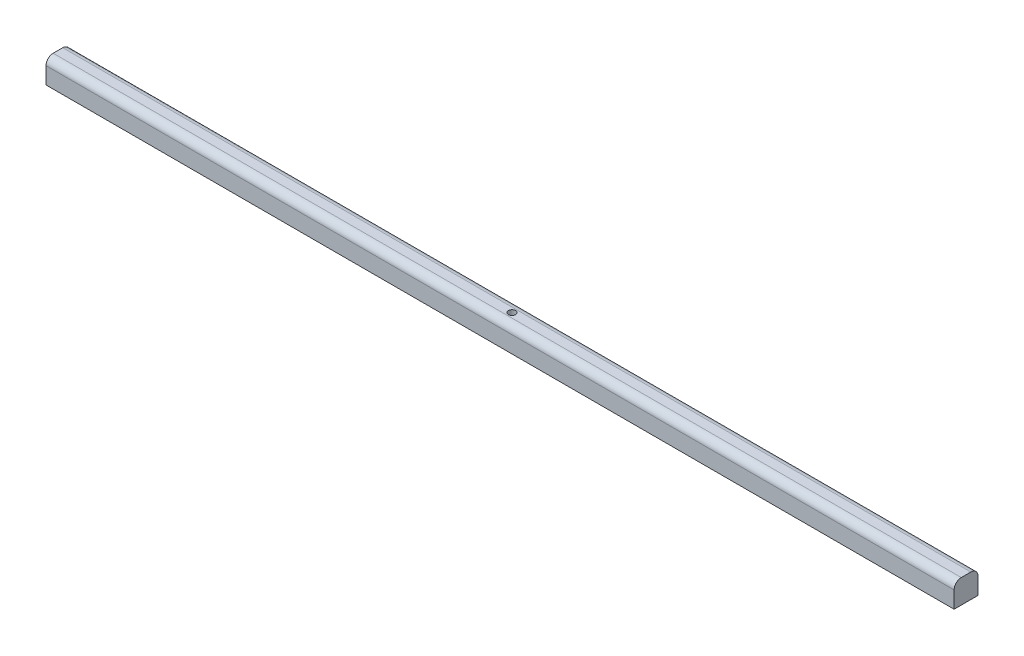
ISO-10303-21;
HEADER;
FILE_DESCRIPTION(('STEP AP214'),'2;1');
FILE_NAME('part.step','',(''),(''),'','','');
FILE_SCHEMA(('AUTOMOTIVE_DESIGN { 1 0 10303 214 1 1 1 1 }'));
ENDSEC;
DATA;
#1=APPLICATION_CONTEXT('core data for automotive mechanical design processes');
#2=APPLICATION_PROTOCOL_DEFINITION('international standard','automotive_design',2000,#1);
#3=PRODUCT_CONTEXT('',#1,'mechanical');
#4=PRODUCT('Part','Part','',(#3));
#5=PRODUCT_RELATED_PRODUCT_CATEGORY('part','',(#4));
#6=PRODUCT_DEFINITION_FORMATION('','',#4);
#7=PRODUCT_DEFINITION_CONTEXT('part definition',#1,'design');
#8=PRODUCT_DEFINITION('design','',#6,#7);
#9=PRODUCT_DEFINITION_SHAPE('','',#8);
#10=(LENGTH_UNIT() NAMED_UNIT(*) SI_UNIT(.MILLI.,.METRE.));
#11=(NAMED_UNIT(*) PLANE_ANGLE_UNIT() SI_UNIT($,.RADIAN.));
#12=(NAMED_UNIT(*) SI_UNIT($,.STERADIAN.) SOLID_ANGLE_UNIT());
#13=UNCERTAINTY_MEASURE_WITH_UNIT(LENGTH_MEASURE(1.E-05),#10,'distance_accuracy_value','');
#14=(GEOMETRIC_REPRESENTATION_CONTEXT(3) GLOBAL_UNCERTAINTY_ASSIGNED_CONTEXT((#13)) GLOBAL_UNIT_ASSIGNED_CONTEXT((#10,
#11,#12)) REPRESENTATION_CONTEXT('',''));
#15=CARTESIAN_POINT('',(0.,0.,0.));
#16=DIRECTION('',(0.,0.,1.));
#17=DIRECTION('',(1.,0.,0.));
#18=AXIS2_PLACEMENT_3D('',#15,#16,#17);
#19=CARTESIAN_POINT('',(190.,10.,-5.));
#20=DIRECTION('',(-1.,0.,0.));
#21=DIRECTION('',(0.,0.,1.));
#22=AXIS2_PLACEMENT_3D('',#19,#20,#21);
#23=PLANE('',#22);
#24=DIRECTION('',(0.,-1.,0.));
#25=VECTOR('',#24,1.);
#26=CARTESIAN_POINT('',(190.,10.,-5.));
#27=LINE('',#26,#25);
#28=CARTESIAN_POINT('',(190.,7.,-5.));
#29=VERTEX_POINT('',#28);
#30=CARTESIAN_POINT('',(190.,0.,-5.));
#31=VERTEX_POINT('',#30);
#32=EDGE_CURVE('E95',#29,#31,#27,.T.);
#33=ORIENTED_EDGE('',*,*,#32,.F.);
#34=CARTESIAN_POINT('',(190.,7.,-2.));
#35=DIRECTION('',(-1.,0.,0.));
#36=DIRECTION('',(0.,0.,1.));
#37=AXIS2_PLACEMENT_3D('',#34,#35,#36);
#38=CIRCLE('',#37,3.);
#39=CARTESIAN_POINT('',(190.,10.,-2.));
#40=VERTEX_POINT('',#39);
#41=EDGE_CURVE('E52',#29,#40,#38,.F.);
#42=ORIENTED_EDGE('',*,*,#41,.T.);
#43=DIRECTION('',(0.,0.,-1.));
#44=VECTOR('',#43,1.);
#45=CARTESIAN_POINT('',(190.,10.,-5.));
#46=LINE('',#45,#44);
#47=CARTESIAN_POINT('',(190.,10.,2.));
#48=VERTEX_POINT('',#47);
#49=EDGE_CURVE('E133',#48,#40,#46,.T.);
#50=ORIENTED_EDGE('',*,*,#49,.F.);
#51=CARTESIAN_POINT('',(190.,7.,2.));
#52=DIRECTION('',(-1.,0.,0.));
#53=DIRECTION('',(0.,0.,1.));
#54=AXIS2_PLACEMENT_3D('',#51,#52,#53);
#55=CIRCLE('',#54,3.);
#56=CARTESIAN_POINT('',(190.,7.,5.));
#57=VERTEX_POINT('',#56);
#58=EDGE_CURVE('E59',#48,#57,#55,.F.);
#59=ORIENTED_EDGE('',*,*,#58,.T.);
#60=DIRECTION('',(0.,-1.,0.));
#61=VECTOR('',#60,1.);
#62=CARTESIAN_POINT('',(190.,10.,5.));
#63=LINE('',#62,#61);
#64=CARTESIAN_POINT('',(190.,0.,5.));
#65=VERTEX_POINT('',#64);
#66=EDGE_CURVE('E115',#57,#65,#63,.T.);
#67=ORIENTED_EDGE('',*,*,#66,.T.);
#68=DIRECTION('',(0.,0.,-1.));
#69=VECTOR('',#68,1.);
#70=CARTESIAN_POINT('',(190.,0.,-5.));
#71=LINE('',#70,#69);
#72=EDGE_CURVE('E110',#65,#31,#71,.T.);
#73=ORIENTED_EDGE('',*,*,#72,.T.);
#74=EDGE_LOOP('',(#33,#42,#50,#59,#67,#73));
#75=FACE_BOUND('',#74,.T.);
#76=ADVANCED_FACE('F43',(#75),#23,.F.);
#77=CARTESIAN_POINT('',(-190.,10.,-5.));
#78=DIRECTION('',(0.,0.,1.));
#79=DIRECTION('',(1.,0.,0.));
#80=AXIS2_PLACEMENT_3D('',#77,#78,#79);
#81=PLANE('',#80);
#82=DIRECTION('',(0.,-1.,0.));
#83=VECTOR('',#82,1.);
#84=CARTESIAN_POINT('',(-190.,10.,-5.));
#85=LINE('',#84,#83);
#86=CARTESIAN_POINT('',(-190.,7.,-5.));
#87=VERTEX_POINT('',#86);
#88=CARTESIAN_POINT('',(-190.,0.,-5.));
#89=VERTEX_POINT('',#88);
#90=EDGE_CURVE('E104',#87,#89,#85,.T.);
#91=ORIENTED_EDGE('',*,*,#90,.F.);
#92=DIRECTION('',(-1.,0.,0.));
#93=VECTOR('',#92,1.);
#94=CARTESIAN_POINT('',(190.,7.,-5.));
#95=LINE('',#94,#93);
#96=EDGE_CURVE('E67',#87,#29,#95,.F.);
#97=ORIENTED_EDGE('',*,*,#96,.T.);
#98=ORIENTED_EDGE('',*,*,#32,.T.);
#99=DIRECTION('',(-1.,0.,0.));
#100=VECTOR('',#99,1.);
#101=CARTESIAN_POINT('',(-190.,0.,-5.));
#102=LINE('',#101,#100);
#103=EDGE_CURVE('E98',#31,#89,#102,.T.);
#104=ORIENTED_EDGE('',*,*,#103,.T.);
#105=EDGE_LOOP('',(#91,#97,#98,#104));
#106=FACE_BOUND('',#105,.T.);
#107=ADVANCED_FACE('F97',(#106),#81,.F.);
#108=CARTESIAN_POINT('',(-190.,10.,-5.));
#109=DIRECTION('',(1.,0.,0.));
#110=DIRECTION('',(0.,0.,-1.));
#111=AXIS2_PLACEMENT_3D('',#108,#109,#110);
#112=PLANE('',#111);
#113=DIRECTION('',(0.,0.,1.));
#114=VECTOR('',#113,1.);
#115=CARTESIAN_POINT('',(-190.,10.,-5.));
#116=LINE('',#115,#114);
#117=CARTESIAN_POINT('',(-190.,10.,-2.));
#118=VERTEX_POINT('',#117);
#119=CARTESIAN_POINT('',(-190.,10.,2.));
#120=VERTEX_POINT('',#119);
#121=EDGE_CURVE('E125',#118,#120,#116,.T.);
#122=ORIENTED_EDGE('',*,*,#121,.F.);
#123=CARTESIAN_POINT('',(-190.,7.,-2.));
#124=DIRECTION('',(1.,0.,0.));
#125=DIRECTION('',(0.,0.,-1.));
#126=AXIS2_PLACEMENT_3D('',#123,#124,#125);
#127=CIRCLE('',#126,3.);
#128=EDGE_CURVE('E151',#118,#87,#127,.F.);
#129=ORIENTED_EDGE('',*,*,#128,.T.);
#130=ORIENTED_EDGE('',*,*,#90,.T.);
#131=DIRECTION('',(0.,0.,1.));
#132=VECTOR('',#131,1.);
#133=CARTESIAN_POINT('',(-190.,0.,-5.));
#134=LINE('',#133,#132);
#135=CARTESIAN_POINT('',(-190.,0.,5.));
#136=VERTEX_POINT('',#135);
#137=EDGE_CURVE('E112',#89,#136,#134,.T.);
#138=ORIENTED_EDGE('',*,*,#137,.T.);
#139=DIRECTION('',(0.,-1.,0.));
#140=VECTOR('',#139,1.);
#141=CARTESIAN_POINT('',(-190.,10.,5.));
#142=LINE('',#141,#140);
#143=CARTESIAN_POINT('',(-190.,7.,5.));
#144=VERTEX_POINT('',#143);
#145=EDGE_CURVE('E136',#144,#136,#142,.T.);
#146=ORIENTED_EDGE('',*,*,#145,.F.);
#147=CARTESIAN_POINT('',(-190.,7.,2.));
#148=DIRECTION('',(1.,0.,0.));
#149=DIRECTION('',(0.,0.,-1.));
#150=AXIS2_PLACEMENT_3D('',#147,#148,#149);
#151=CIRCLE('',#150,3.);
#152=EDGE_CURVE('E148',#144,#120,#151,.F.);
#153=ORIENTED_EDGE('',*,*,#152,.T.);
#154=EDGE_LOOP('',(#122,#129,#130,#138,#146,#153));
#155=FACE_BOUND('',#154,.T.);
#156=ADVANCED_FACE('F169',(#155),#112,.F.);
#157=CARTESIAN_POINT('',(-190.,10.,5.));
#158=DIRECTION('',(0.,0.,-1.));
#159=DIRECTION('',(-1.,0.,0.));
#160=AXIS2_PLACEMENT_3D('',#157,#158,#159);
#161=PLANE('',#160);
#162=ORIENTED_EDGE('',*,*,#66,.F.);
#163=DIRECTION('',(1.,0.,0.));
#164=VECTOR('',#163,1.);
#165=CARTESIAN_POINT('',(-190.,7.,5.));
#166=LINE('',#165,#164);
#167=EDGE_CURVE('E11',#57,#144,#166,.F.);
#168=ORIENTED_EDGE('',*,*,#167,.T.);
#169=ORIENTED_EDGE('',*,*,#145,.T.);
#170=DIRECTION('',(1.,0.,0.));
#171=VECTOR('',#170,1.);
#172=CARTESIAN_POINT('',(-190.,0.,5.));
#173=LINE('',#172,#171);
#174=EDGE_CURVE('E130',#136,#65,#173,.T.);
#175=ORIENTED_EDGE('',*,*,#174,.T.);
#176=EDGE_LOOP('',(#162,#168,#169,#175));
#177=FACE_BOUND('',#176,.T.);
#178=ADVANCED_FACE('F176',(#177),#161,.F.);
#179=CARTESIAN_POINT('',(0.,10.,0.));
#180=DIRECTION('',(0.,1.,0.));
#181=DIRECTION('',(0.,0.,1.));
#182=AXIS2_PLACEMENT_3D('',#179,#180,#181);
#183=PLANE('',#182);
#184=CARTESIAN_POINT('',(0.,10.,0.));
#185=DIRECTION('',(0.,-1.,0.));
#186=DIRECTION('',(0.,0.,-1.));
#187=AXIS2_PLACEMENT_3D('',#184,#185,#186);
#188=CIRCLE('',#187,1.5);
#189=CARTESIAN_POINT('',(0.,10.,-1.5));
#190=VERTEX_POINT('',#189);
#191=EDGE_CURVE('E118',#190,#190,#188,.T.);
#192=ORIENTED_EDGE('',*,*,#191,.T.);
#193=EDGE_LOOP('',(#192));
#194=FACE_BOUND('',#193,.T.);
#195=ORIENTED_EDGE('',*,*,#49,.T.);
#196=DIRECTION('',(-1.,0.,0.));
#197=VECTOR('',#196,1.);
#198=CARTESIAN_POINT('',(-190.,10.,-2.));
#199=LINE('',#198,#197);
#200=EDGE_CURVE('E144',#40,#118,#199,.T.);
#201=ORIENTED_EDGE('',*,*,#200,.T.);
#202=ORIENTED_EDGE('',*,*,#121,.T.);
#203=DIRECTION('',(1.,0.,0.));
#204=VECTOR('',#203,1.);
#205=CARTESIAN_POINT('',(190.,10.,2.));
#206=LINE('',#205,#204);
#207=EDGE_CURVE('E103',#120,#48,#206,.T.);
#208=ORIENTED_EDGE('',*,*,#207,.T.);
#209=EDGE_LOOP('',(#195,#201,#202,#208));
#210=FACE_BOUND('',#209,.T.);
#211=ADVANCED_FACE('F162',(#194,#210),#183,.T.);
#212=CARTESIAN_POINT('',(0.,0.,0.));
#213=DIRECTION('',(0.,1.,0.));
#214=DIRECTION('',(0.,0.,1.));
#215=AXIS2_PLACEMENT_3D('',#212,#213,#214);
#216=PLANE('',#215);
#217=CARTESIAN_POINT('',(0.,0.,0.));
#218=DIRECTION('',(0.,-1.,0.));
#219=DIRECTION('',(0.,0.,-1.));
#220=AXIS2_PLACEMENT_3D('',#217,#218,#219);
#221=CIRCLE('',#220,1.5);
#222=CARTESIAN_POINT('',(0.,0.,-1.5));
#223=VERTEX_POINT('',#222);
#224=EDGE_CURVE('E122',#223,#223,#221,.T.);
#225=ORIENTED_EDGE('',*,*,#224,.F.);
#226=EDGE_LOOP('',(#225));
#227=FACE_BOUND('',#226,.T.);
#228=ORIENTED_EDGE('',*,*,#72,.F.);
#229=ORIENTED_EDGE('',*,*,#174,.F.);
#230=ORIENTED_EDGE('',*,*,#137,.F.);
#231=ORIENTED_EDGE('',*,*,#103,.F.);
#232=EDGE_LOOP('',(#228,#229,#230,#231));
#233=FACE_BOUND('',#232,.T.);
#234=ADVANCED_FACE('F108',(#227,#233),#216,.F.);
#235=CARTESIAN_POINT('',(0.,7.,-2.));
#236=DIRECTION('',(1.,0.,0.));
#237=DIRECTION('',(0.,0.,-1.));
#238=AXIS2_PLACEMENT_3D('',#235,#236,#237);
#239=CYLINDRICAL_SURFACE('',#238,3.);
#240=ORIENTED_EDGE('',*,*,#41,.F.);
#241=ORIENTED_EDGE('',*,*,#96,.F.);
#242=ORIENTED_EDGE('',*,*,#128,.F.);
#243=ORIENTED_EDGE('',*,*,#200,.F.);
#244=EDGE_LOOP('',(#240,#241,#242,#243));
#245=FACE_BOUND('',#244,.T.);
#246=ADVANCED_FACE('F167',(#245),#239,.T.);
#247=CARTESIAN_POINT('',(0.,7.,2.));
#248=DIRECTION('',(-1.,0.,0.));
#249=DIRECTION('',(0.,0.,1.));
#250=AXIS2_PLACEMENT_3D('',#247,#248,#249);
#251=CYLINDRICAL_SURFACE('',#250,3.);
#252=ORIENTED_EDGE('',*,*,#152,.F.);
#253=ORIENTED_EDGE('',*,*,#167,.F.);
#254=ORIENTED_EDGE('',*,*,#58,.F.);
#255=ORIENTED_EDGE('',*,*,#207,.F.);
#256=EDGE_LOOP('',(#252,#253,#254,#255));
#257=FACE_BOUND('',#256,.T.);
#258=ADVANCED_FACE('F45',(#257),#251,.T.);
#259=CARTESIAN_POINT('',(0.,10.,0.));
#260=DIRECTION('',(0.,-1.,0.));
#261=DIRECTION('',(0.,0.,-1.));
#262=AXIS2_PLACEMENT_3D('',#259,#260,#261);
#263=CYLINDRICAL_SURFACE('',#262,1.5);
#264=ORIENTED_EDGE('',*,*,#191,.F.);
#265=EDGE_LOOP('',(#264));
#266=FACE_BOUND('',#265,.T.);
#267=ORIENTED_EDGE('',*,*,#224,.T.);
#268=EDGE_LOOP('',(#267));
#269=FACE_BOUND('',#268,.T.);
#270=ADVANCED_FACE('F198',(#266,#269),#263,.F.);
#271=CLOSED_SHELL('',(#76,#107,#156,#178,#211,#234,#246,#258,#270));
#272=MANIFOLD_SOLID_BREP('B2',#271);
#273=ADVANCED_BREP_SHAPE_REPRESENTATION('',(#18,#272),#14);
#274=SHAPE_DEFINITION_REPRESENTATION(#9,#273);
ENDSEC;
END-ISO-10303-21;
